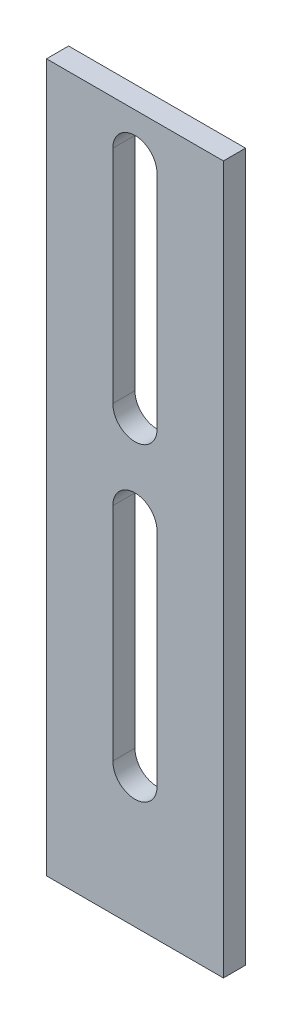
ISO-10303-21;
HEADER;
FILE_DESCRIPTION(('STEP AP214'),'2;1');
FILE_NAME('part.step','',(''),(''),'','','');
FILE_SCHEMA(('AUTOMOTIVE_DESIGN { 1 0 10303 214 1 1 1 1 }'));
ENDSEC;
DATA;
#1=APPLICATION_CONTEXT('core data for automotive mechanical design processes');
#2=APPLICATION_PROTOCOL_DEFINITION('international standard','automotive_design',2000,#1);
#3=PRODUCT_CONTEXT('',#1,'mechanical');
#4=PRODUCT('Part','Part','',(#3));
#5=PRODUCT_RELATED_PRODUCT_CATEGORY('part','',(#4));
#6=PRODUCT_DEFINITION_FORMATION('','',#4);
#7=PRODUCT_DEFINITION_CONTEXT('part definition',#1,'design');
#8=PRODUCT_DEFINITION('design','',#6,#7);
#9=PRODUCT_DEFINITION_SHAPE('','',#8);
#10=(LENGTH_UNIT() NAMED_UNIT(*) SI_UNIT(.MILLI.,.METRE.));
#11=(NAMED_UNIT(*) PLANE_ANGLE_UNIT() SI_UNIT($,.RADIAN.));
#12=(NAMED_UNIT(*) SI_UNIT($,.STERADIAN.) SOLID_ANGLE_UNIT());
#13=UNCERTAINTY_MEASURE_WITH_UNIT(LENGTH_MEASURE(1.E-05),#10,'distance_accuracy_value','');
#14=(GEOMETRIC_REPRESENTATION_CONTEXT(3) GLOBAL_UNCERTAINTY_ASSIGNED_CONTEXT((#13)) GLOBAL_UNIT_ASSIGNED_CONTEXT((#10,
#11,#12)) REPRESENTATION_CONTEXT('',''));
#15=CARTESIAN_POINT('',(0.,0.,0.));
#16=DIRECTION('',(0.,0.,1.));
#17=DIRECTION('',(1.,0.,0.));
#18=AXIS2_PLACEMENT_3D('',#15,#16,#17);
#19=CARTESIAN_POINT('',(0.,0.,3.175));
#20=DIRECTION('',(0.,0.,1.));
#21=DIRECTION('',(1.,0.,0.));
#22=AXIS2_PLACEMENT_3D('',#19,#20,#21);
#23=PLANE('',#22);
#24=CARTESIAN_POINT('',(0.,-69.85,3.175));
#25=DIRECTION('',(0.,0.,1.));
#26=DIRECTION('',(1.,0.,0.));
#27=AXIS2_PLACEMENT_3D('',#24,#25,#26);
#28=CIRCLE('',#27,3.175);
#29=CARTESIAN_POINT('',(-3.175,-69.85,3.175));
#30=VERTEX_POINT('',#29);
#31=CARTESIAN_POINT('',(3.175,-69.85,3.175));
#32=VERTEX_POINT('',#31);
#33=EDGE_CURVE('E59',#30,#32,#28,.T.);
#34=ORIENTED_EDGE('',*,*,#33,.F.);
#35=DIRECTION('',(0.,-1.,0.));
#36=VECTOR('',#35,1.);
#37=CARTESIAN_POINT('',(-3.175,-69.85,3.175));
#38=LINE('',#37,#36);
#39=CARTESIAN_POINT('',(-3.175,-38.1,3.175));
#40=VERTEX_POINT('',#39);
#41=EDGE_CURVE('E151',#40,#30,#38,.T.);
#42=ORIENTED_EDGE('',*,*,#41,.F.);
#43=CARTESIAN_POINT('',(0.,-38.1,3.175));
#44=DIRECTION('',(0.,0.,1.));
#45=DIRECTION('',(1.,0.,0.));
#46=AXIS2_PLACEMENT_3D('',#43,#44,#45);
#47=CIRCLE('',#46,3.175);
#48=CARTESIAN_POINT('',(3.175,-38.1,3.175));
#49=VERTEX_POINT('',#48);
#50=EDGE_CURVE('E154',#49,#40,#47,.T.);
#51=ORIENTED_EDGE('',*,*,#50,.F.);
#52=DIRECTION('',(0.,1.,0.));
#53=VECTOR('',#52,1.);
#54=CARTESIAN_POINT('',(3.175,-69.85,3.175));
#55=LINE('',#54,#53);
#56=EDGE_CURVE('E160',#32,#49,#55,.T.);
#57=ORIENTED_EDGE('',*,*,#56,.F.);
#58=EDGE_LOOP('',(#34,#42,#51,#57));
#59=FACE_BOUND('',#58,.T.);
#60=CARTESIAN_POINT('',(0.,-25.4,3.175));
#61=DIRECTION('',(0.,0.,1.));
#62=DIRECTION('',(1.,0.,0.));
#63=AXIS2_PLACEMENT_3D('',#60,#61,#62);
#64=CIRCLE('',#63,3.175);
#65=CARTESIAN_POINT('',(-3.175,-25.4,3.175));
#66=VERTEX_POINT('',#65);
#67=CARTESIAN_POINT('',(3.175,-25.4,3.175));
#68=VERTEX_POINT('',#67);
#69=EDGE_CURVE('E166',#66,#68,#64,.T.);
#70=ORIENTED_EDGE('',*,*,#69,.F.);
#71=DIRECTION('',(0.,-1.,0.));
#72=VECTOR('',#71,1.);
#73=CARTESIAN_POINT('',(-3.175,-25.4,3.175));
#74=LINE('',#73,#72);
#75=CARTESIAN_POINT('',(-3.175,6.35,3.175));
#76=VERTEX_POINT('',#75);
#77=EDGE_CURVE('E174',#76,#66,#74,.T.);
#78=ORIENTED_EDGE('',*,*,#77,.F.);
#79=CARTESIAN_POINT('',(0.,6.34999999999999,3.175));
#80=DIRECTION('',(0.,0.,1.));
#81=DIRECTION('',(1.,0.,0.));
#82=AXIS2_PLACEMENT_3D('',#79,#80,#81);
#83=CIRCLE('',#82,3.175);
#84=CARTESIAN_POINT('',(3.175,6.35,3.175));
#85=VERTEX_POINT('',#84);
#86=EDGE_CURVE('E188',#85,#76,#83,.T.);
#87=ORIENTED_EDGE('',*,*,#86,.F.);
#88=DIRECTION('',(0.,1.,0.));
#89=VECTOR('',#88,1.);
#90=CARTESIAN_POINT('',(3.175,-25.4,3.175));
#91=LINE('',#90,#89);
#92=EDGE_CURVE('E185',#68,#85,#91,.T.);
#93=ORIENTED_EDGE('',*,*,#92,.F.);
#94=EDGE_LOOP('',(#70,#78,#87,#93));
#95=FACE_BOUND('',#94,.T.);
#96=DIRECTION('',(0.,-1.,0.));
#97=VECTOR('',#96,1.);
#98=CARTESIAN_POINT('',(-12.7,12.7,3.175));
#99=LINE('',#98,#97);
#100=CARTESIAN_POINT('',(-12.7,12.7,3.175));
#101=VERTEX_POINT('',#100);
#102=CARTESIAN_POINT('',(-12.7,-88.9,3.175));
#103=VERTEX_POINT('',#102);
#104=EDGE_CURVE('E202',#101,#103,#99,.T.);
#105=ORIENTED_EDGE('',*,*,#104,.T.);
#106=DIRECTION('',(1.,0.,0.));
#107=VECTOR('',#106,1.);
#108=CARTESIAN_POINT('',(-12.7,-88.9,3.175));
#109=LINE('',#108,#107);
#110=CARTESIAN_POINT('',(12.7,-88.9,3.175));
#111=VERTEX_POINT('',#110);
#112=EDGE_CURVE('E205',#103,#111,#109,.T.);
#113=ORIENTED_EDGE('',*,*,#112,.T.);
#114=DIRECTION('',(0.,1.,0.));
#115=VECTOR('',#114,1.);
#116=CARTESIAN_POINT('',(12.7,12.7,3.175));
#117=LINE('',#116,#115);
#118=CARTESIAN_POINT('',(12.7,12.7,3.175));
#119=VERTEX_POINT('',#118);
#120=EDGE_CURVE('E208',#111,#119,#117,.T.);
#121=ORIENTED_EDGE('',*,*,#120,.T.);
#122=DIRECTION('',(-1.,0.,0.));
#123=VECTOR('',#122,1.);
#124=CARTESIAN_POINT('',(-12.7,12.7,3.175));
#125=LINE('',#124,#123);
#126=EDGE_CURVE('E210',#119,#101,#125,.T.);
#127=ORIENTED_EDGE('',*,*,#126,.T.);
#128=EDGE_LOOP('',(#105,#113,#121,#127));
#129=FACE_BOUND('',#128,.T.);
#130=ADVANCED_FACE('F44',(#59,#95,#129),#23,.T.);
#131=CARTESIAN_POINT('',(0.,0.,0.));
#132=DIRECTION('',(0.,0.,1.));
#133=DIRECTION('',(1.,0.,0.));
#134=AXIS2_PLACEMENT_3D('',#131,#132,#133);
#135=PLANE('',#134);
#136=DIRECTION('',(0.,-1.,0.));
#137=VECTOR('',#136,1.);
#138=CARTESIAN_POINT('',(-3.175,-69.85,0.));
#139=LINE('',#138,#137);
#140=CARTESIAN_POINT('',(-3.175,-38.1,0.));
#141=VERTEX_POINT('',#140);
#142=CARTESIAN_POINT('',(-3.175,-69.85,0.));
#143=VERTEX_POINT('',#142);
#144=EDGE_CURVE('E141',#141,#143,#139,.T.);
#145=ORIENTED_EDGE('',*,*,#144,.T.);
#146=CARTESIAN_POINT('',(0.,-69.85,0.));
#147=DIRECTION('',(0.,0.,1.));
#148=DIRECTION('',(1.,0.,0.));
#149=AXIS2_PLACEMENT_3D('',#146,#147,#148);
#150=CIRCLE('',#149,3.175);
#151=CARTESIAN_POINT('',(3.175,-69.85,0.));
#152=VERTEX_POINT('',#151);
#153=EDGE_CURVE('E135',#143,#152,#150,.T.);
#154=ORIENTED_EDGE('',*,*,#153,.T.);
#155=DIRECTION('',(0.,1.,0.));
#156=VECTOR('',#155,1.);
#157=CARTESIAN_POINT('',(3.175,-69.85,0.));
#158=LINE('',#157,#156);
#159=CARTESIAN_POINT('',(3.175,-38.1,0.));
#160=VERTEX_POINT('',#159);
#161=EDGE_CURVE('E144',#152,#160,#158,.T.);
#162=ORIENTED_EDGE('',*,*,#161,.T.);
#163=CARTESIAN_POINT('',(0.,-38.1,0.));
#164=DIRECTION('',(0.,0.,1.));
#165=DIRECTION('',(1.,0.,0.));
#166=AXIS2_PLACEMENT_3D('',#163,#164,#165);
#167=CIRCLE('',#166,3.175);
#168=EDGE_CURVE('E67',#160,#141,#167,.T.);
#169=ORIENTED_EDGE('',*,*,#168,.T.);
#170=EDGE_LOOP('',(#145,#154,#162,#169));
#171=FACE_BOUND('',#170,.T.);
#172=DIRECTION('',(0.,-1.,0.));
#173=VECTOR('',#172,1.);
#174=CARTESIAN_POINT('',(-3.175,-25.4,0.));
#175=LINE('',#174,#173);
#176=CARTESIAN_POINT('',(-3.175,6.35,0.));
#177=VERTEX_POINT('',#176);
#178=CARTESIAN_POINT('',(-3.175,-25.4,0.));
#179=VERTEX_POINT('',#178);
#180=EDGE_CURVE('E180',#177,#179,#175,.T.);
#181=ORIENTED_EDGE('',*,*,#180,.T.);
#182=CARTESIAN_POINT('',(0.,-25.4,0.));
#183=DIRECTION('',(0.,0.,1.));
#184=DIRECTION('',(1.,0.,0.));
#185=AXIS2_PLACEMENT_3D('',#182,#183,#184);
#186=CIRCLE('',#185,3.175);
#187=CARTESIAN_POINT('',(3.175,-25.4,0.));
#188=VERTEX_POINT('',#187);
#189=EDGE_CURVE('E170',#179,#188,#186,.T.);
#190=ORIENTED_EDGE('',*,*,#189,.T.);
#191=DIRECTION('',(0.,1.,0.));
#192=VECTOR('',#191,1.);
#193=CARTESIAN_POINT('',(3.175,-25.4,0.));
#194=LINE('',#193,#192);
#195=CARTESIAN_POINT('',(3.175,6.35,0.));
#196=VERTEX_POINT('',#195);
#197=EDGE_CURVE('E173',#188,#196,#194,.T.);
#198=ORIENTED_EDGE('',*,*,#197,.T.);
#199=CARTESIAN_POINT('',(0.,6.34999999999999,0.));
#200=DIRECTION('',(0.,0.,1.));
#201=DIRECTION('',(1.,0.,0.));
#202=AXIS2_PLACEMENT_3D('',#199,#200,#201);
#203=CIRCLE('',#202,3.175);
#204=EDGE_CURVE('E177',#196,#177,#203,.T.);
#205=ORIENTED_EDGE('',*,*,#204,.T.);
#206=EDGE_LOOP('',(#181,#190,#198,#205));
#207=FACE_BOUND('',#206,.T.);
#208=DIRECTION('',(0.,-1.,0.));
#209=VECTOR('',#208,1.);
#210=CARTESIAN_POINT('',(-12.7,12.7,0.));
#211=LINE('',#210,#209);
#212=CARTESIAN_POINT('',(-12.7,12.7,0.));
#213=VERTEX_POINT('',#212);
#214=CARTESIAN_POINT('',(-12.7,-88.9,0.));
#215=VERTEX_POINT('',#214);
#216=EDGE_CURVE('E195',#213,#215,#211,.T.);
#217=ORIENTED_EDGE('',*,*,#216,.F.);
#218=DIRECTION('',(-1.,0.,0.));
#219=VECTOR('',#218,1.);
#220=CARTESIAN_POINT('',(-12.7,12.7,0.));
#221=LINE('',#220,#219);
#222=CARTESIAN_POINT('',(12.7,12.7,0.));
#223=VERTEX_POINT('',#222);
#224=EDGE_CURVE('E206',#223,#213,#221,.T.);
#225=ORIENTED_EDGE('',*,*,#224,.F.);
#226=DIRECTION('',(0.,1.,0.));
#227=VECTOR('',#226,1.);
#228=CARTESIAN_POINT('',(12.7,12.7,0.));
#229=LINE('',#228,#227);
#230=CARTESIAN_POINT('',(12.7,-88.9,0.));
#231=VERTEX_POINT('',#230);
#232=EDGE_CURVE('E217',#231,#223,#229,.T.);
#233=ORIENTED_EDGE('',*,*,#232,.F.);
#234=DIRECTION('',(1.,0.,0.));
#235=VECTOR('',#234,1.);
#236=CARTESIAN_POINT('',(-12.7,-88.9,0.));
#237=LINE('',#236,#235);
#238=EDGE_CURVE('E215',#215,#231,#237,.T.);
#239=ORIENTED_EDGE('',*,*,#238,.F.);
#240=EDGE_LOOP('',(#217,#225,#233,#239));
#241=FACE_BOUND('',#240,.T.);
#242=ADVANCED_FACE('F148',(#171,#207,#241),#135,.F.);
#243=CARTESIAN_POINT('',(-12.7,12.7,3.175));
#244=DIRECTION('',(1.,0.,0.));
#245=DIRECTION('',(0.,1.,0.));
#246=AXIS2_PLACEMENT_3D('',#243,#244,#245);
#247=PLANE('',#246);
#248=ORIENTED_EDGE('',*,*,#216,.T.);
#249=DIRECTION('',(0.,0.,-1.));
#250=VECTOR('',#249,1.);
#251=CARTESIAN_POINT('',(-12.7,-88.9,3.175));
#252=LINE('',#251,#250);
#253=EDGE_CURVE('E13',#103,#215,#252,.T.);
#254=ORIENTED_EDGE('',*,*,#253,.F.);
#255=ORIENTED_EDGE('',*,*,#104,.F.);
#256=DIRECTION('',(0.,0.,-1.));
#257=VECTOR('',#256,1.);
#258=CARTESIAN_POINT('',(-12.7,12.7,3.175));
#259=LINE('',#258,#257);
#260=EDGE_CURVE('E212',#101,#213,#259,.T.);
#261=ORIENTED_EDGE('',*,*,#260,.T.);
#262=EDGE_LOOP('',(#248,#254,#255,#261));
#263=FACE_BOUND('',#262,.T.);
#264=ADVANCED_FACE('F46',(#263),#247,.F.);
#265=CARTESIAN_POINT('',(-12.7,-88.9,3.175));
#266=DIRECTION('',(0.,1.,0.));
#267=DIRECTION('',(0.,0.,1.));
#268=AXIS2_PLACEMENT_3D('',#265,#266,#267);
#269=PLANE('',#268);
#270=ORIENTED_EDGE('',*,*,#238,.T.);
#271=DIRECTION('',(0.,0.,-1.));
#272=VECTOR('',#271,1.);
#273=CARTESIAN_POINT('',(12.7,-88.9,3.175));
#274=LINE('',#273,#272);
#275=EDGE_CURVE('E52',#111,#231,#274,.T.);
#276=ORIENTED_EDGE('',*,*,#275,.F.);
#277=ORIENTED_EDGE('',*,*,#112,.F.);
#278=ORIENTED_EDGE('',*,*,#253,.T.);
#279=EDGE_LOOP('',(#270,#276,#277,#278));
#280=FACE_BOUND('',#279,.T.);
#281=ADVANCED_FACE('F243',(#280),#269,.F.);
#282=CARTESIAN_POINT('',(12.7,12.7,3.175));
#283=DIRECTION('',(-1.,0.,0.));
#284=DIRECTION('',(0.,-1.,0.));
#285=AXIS2_PLACEMENT_3D('',#282,#283,#284);
#286=PLANE('',#285);
#287=ORIENTED_EDGE('',*,*,#232,.T.);
#288=DIRECTION('',(0.,0.,-1.));
#289=VECTOR('',#288,1.);
#290=CARTESIAN_POINT('',(12.7,12.7,3.175));
#291=LINE('',#290,#289);
#292=EDGE_CURVE('E222',#119,#223,#291,.T.);
#293=ORIENTED_EDGE('',*,*,#292,.F.);
#294=ORIENTED_EDGE('',*,*,#120,.F.);
#295=ORIENTED_EDGE('',*,*,#275,.T.);
#296=EDGE_LOOP('',(#287,#293,#294,#295));
#297=FACE_BOUND('',#296,.T.);
#298=ADVANCED_FACE('F229',(#297),#286,.F.);
#299=CARTESIAN_POINT('',(-12.7,12.7,3.175));
#300=DIRECTION('',(0.,-1.,0.));
#301=DIRECTION('',(0.,0.,-1.));
#302=AXIS2_PLACEMENT_3D('',#299,#300,#301);
#303=PLANE('',#302);
#304=ORIENTED_EDGE('',*,*,#224,.T.);
#305=ORIENTED_EDGE('',*,*,#260,.F.);
#306=ORIENTED_EDGE('',*,*,#126,.F.);
#307=ORIENTED_EDGE('',*,*,#292,.T.);
#308=EDGE_LOOP('',(#304,#305,#306,#307));
#309=FACE_BOUND('',#308,.T.);
#310=ADVANCED_FACE('F237',(#309),#303,.F.);
#311=CARTESIAN_POINT('',(0.,-25.4,0.));
#312=DIRECTION('',(0.,0.,1.));
#313=DIRECTION('',(1.,0.,0.));
#314=AXIS2_PLACEMENT_3D('',#311,#312,#313);
#315=CYLINDRICAL_SURFACE('',#314,3.175);
#316=ORIENTED_EDGE('',*,*,#69,.T.);
#317=DIRECTION('',(0.,0.,1.));
#318=VECTOR('',#317,1.);
#319=CARTESIAN_POINT('',(3.175,-25.4,0.));
#320=LINE('',#319,#318);
#321=EDGE_CURVE('E183',#188,#68,#320,.T.);
#322=ORIENTED_EDGE('',*,*,#321,.F.);
#323=ORIENTED_EDGE('',*,*,#189,.F.);
#324=DIRECTION('',(0.,0.,1.));
#325=VECTOR('',#324,1.);
#326=CARTESIAN_POINT('',(-3.175,-25.4,0.));
#327=LINE('',#326,#325);
#328=EDGE_CURVE('E193',#179,#66,#327,.T.);
#329=ORIENTED_EDGE('',*,*,#328,.T.);
#330=EDGE_LOOP('',(#316,#322,#323,#329));
#331=FACE_BOUND('',#330,.T.);
#332=ADVANCED_FACE('F259',(#331),#315,.F.);
#333=CARTESIAN_POINT('',(-3.175,-25.4,0.));
#334=DIRECTION('',(-1.,0.,0.));
#335=DIRECTION('',(0.,0.,1.));
#336=AXIS2_PLACEMENT_3D('',#333,#334,#335);
#337=PLANE('',#336);
#338=ORIENTED_EDGE('',*,*,#77,.T.);
#339=ORIENTED_EDGE('',*,*,#328,.F.);
#340=ORIENTED_EDGE('',*,*,#180,.F.);
#341=DIRECTION('',(0.,0.,1.));
#342=VECTOR('',#341,1.);
#343=CARTESIAN_POINT('',(-3.175,6.35,0.));
#344=LINE('',#343,#342);
#345=EDGE_CURVE('E196',#177,#76,#344,.T.);
#346=ORIENTED_EDGE('',*,*,#345,.T.);
#347=EDGE_LOOP('',(#338,#339,#340,#346));
#348=FACE_BOUND('',#347,.T.);
#349=ADVANCED_FACE('F266',(#348),#337,.F.);
#350=CARTESIAN_POINT('',(0.,6.34999999999999,0.));
#351=DIRECTION('',(0.,0.,1.));
#352=DIRECTION('',(1.,0.,0.));
#353=AXIS2_PLACEMENT_3D('',#350,#351,#352);
#354=CYLINDRICAL_SURFACE('',#353,3.175);
#355=ORIENTED_EDGE('',*,*,#86,.T.);
#356=ORIENTED_EDGE('',*,*,#345,.F.);
#357=ORIENTED_EDGE('',*,*,#204,.F.);
#358=DIRECTION('',(0.,0.,1.));
#359=VECTOR('',#358,1.);
#360=CARTESIAN_POINT('',(3.175,6.35,0.));
#361=LINE('',#360,#359);
#362=EDGE_CURVE('E198',#196,#85,#361,.T.);
#363=ORIENTED_EDGE('',*,*,#362,.T.);
#364=EDGE_LOOP('',(#355,#356,#357,#363));
#365=FACE_BOUND('',#364,.T.);
#366=ADVANCED_FACE('F271',(#365),#354,.F.);
#367=CARTESIAN_POINT('',(3.175,-25.4,0.));
#368=DIRECTION('',(1.,0.,0.));
#369=DIRECTION('',(0.,0.,-1.));
#370=AXIS2_PLACEMENT_3D('',#367,#368,#369);
#371=PLANE('',#370);
#372=ORIENTED_EDGE('',*,*,#92,.T.);
#373=ORIENTED_EDGE('',*,*,#362,.F.);
#374=ORIENTED_EDGE('',*,*,#197,.F.);
#375=ORIENTED_EDGE('',*,*,#321,.T.);
#376=EDGE_LOOP('',(#372,#373,#374,#375));
#377=FACE_BOUND('',#376,.T.);
#378=ADVANCED_FACE('F280',(#377),#371,.F.);
#379=CARTESIAN_POINT('',(0.,-69.85,0.));
#380=DIRECTION('',(0.,0.,1.));
#381=DIRECTION('',(1.,0.,0.));
#382=AXIS2_PLACEMENT_3D('',#379,#380,#381);
#383=CYLINDRICAL_SURFACE('',#382,3.175);
#384=ORIENTED_EDGE('',*,*,#33,.T.);
#385=DIRECTION('',(0.,0.,1.));
#386=VECTOR('',#385,1.);
#387=CARTESIAN_POINT('',(3.175,-69.85,0.));
#388=LINE('',#387,#386);
#389=EDGE_CURVE('E131',#152,#32,#388,.T.);
#390=ORIENTED_EDGE('',*,*,#389,.F.);
#391=ORIENTED_EDGE('',*,*,#153,.F.);
#392=DIRECTION('',(0.,0.,1.));
#393=VECTOR('',#392,1.);
#394=CARTESIAN_POINT('',(-3.175,-69.85,0.));
#395=LINE('',#394,#393);
#396=EDGE_CURVE('E164',#143,#30,#395,.T.);
#397=ORIENTED_EDGE('',*,*,#396,.T.);
#398=EDGE_LOOP('',(#384,#390,#391,#397));
#399=FACE_BOUND('',#398,.T.);
#400=ADVANCED_FACE('F133',(#399),#383,.F.);
#401=CARTESIAN_POINT('',(-3.175,-69.85,0.));
#402=DIRECTION('',(-1.,0.,0.));
#403=DIRECTION('',(0.,0.,1.));
#404=AXIS2_PLACEMENT_3D('',#401,#402,#403);
#405=PLANE('',#404);
#406=ORIENTED_EDGE('',*,*,#41,.T.);
#407=ORIENTED_EDGE('',*,*,#396,.F.);
#408=ORIENTED_EDGE('',*,*,#144,.F.);
#409=DIRECTION('',(0.,0.,1.));
#410=VECTOR('',#409,1.);
#411=CARTESIAN_POINT('',(-3.175,-38.1,0.));
#412=LINE('',#411,#410);
#413=EDGE_CURVE('E167',#141,#40,#412,.T.);
#414=ORIENTED_EDGE('',*,*,#413,.T.);
#415=EDGE_LOOP('',(#406,#407,#408,#414));
#416=FACE_BOUND('',#415,.T.);
#417=ADVANCED_FACE('F293',(#416),#405,.F.);
#418=CARTESIAN_POINT('',(0.,-38.1,0.));
#419=DIRECTION('',(0.,0.,1.));
#420=DIRECTION('',(1.,0.,0.));
#421=AXIS2_PLACEMENT_3D('',#418,#419,#420);
#422=CYLINDRICAL_SURFACE('',#421,3.175);
#423=ORIENTED_EDGE('',*,*,#50,.T.);
#424=ORIENTED_EDGE('',*,*,#413,.F.);
#425=ORIENTED_EDGE('',*,*,#168,.F.);
#426=DIRECTION('',(0.,0.,1.));
#427=VECTOR('',#426,1.);
#428=CARTESIAN_POINT('',(3.175,-38.1,0.));
#429=LINE('',#428,#427);
#430=EDGE_CURVE('E140',#160,#49,#429,.T.);
#431=ORIENTED_EDGE('',*,*,#430,.T.);
#432=EDGE_LOOP('',(#423,#424,#425,#431));
#433=FACE_BOUND('',#432,.T.);
#434=ADVANCED_FACE('F296',(#433),#422,.F.);
#435=CARTESIAN_POINT('',(3.175,-69.85,0.));
#436=DIRECTION('',(1.,0.,0.));
#437=DIRECTION('',(0.,0.,-1.));
#438=AXIS2_PLACEMENT_3D('',#435,#436,#437);
#439=PLANE('',#438);
#440=ORIENTED_EDGE('',*,*,#56,.T.);
#441=ORIENTED_EDGE('',*,*,#430,.F.);
#442=ORIENTED_EDGE('',*,*,#161,.F.);
#443=ORIENTED_EDGE('',*,*,#389,.T.);
#444=EDGE_LOOP('',(#440,#441,#442,#443));
#445=FACE_BOUND('',#444,.T.);
#446=ADVANCED_FACE('F145',(#445),#439,.F.);
#447=CLOSED_SHELL('',(#130,#242,#264,#281,#298,#310,#332,#349,#366,#378,#400,#417,#434,#446));
#448=MANIFOLD_SOLID_BREP('B2',#447);
#449=ADVANCED_BREP_SHAPE_REPRESENTATION('',(#18,#448),#14);
#450=SHAPE_DEFINITION_REPRESENTATION(#9,#449);
ENDSEC;
END-ISO-10303-21;
